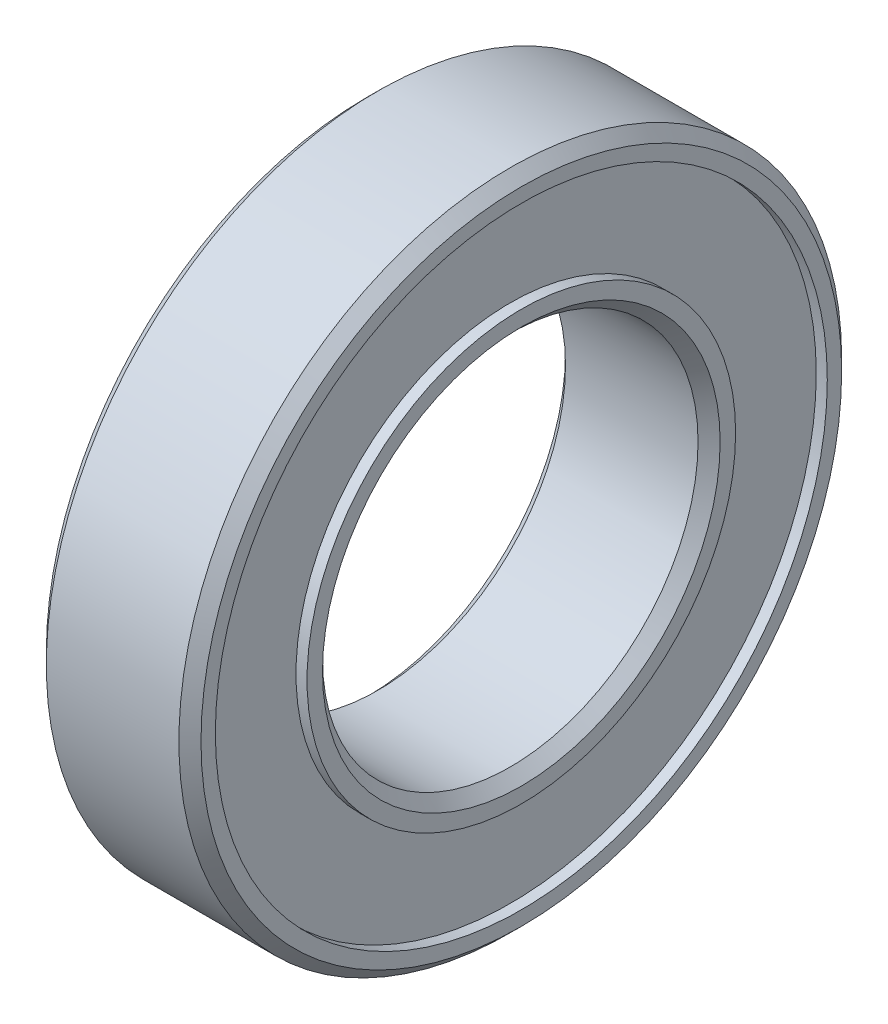
ISO-10303-21;
HEADER;
FILE_DESCRIPTION(('STEP AP214'),'2;1');
FILE_NAME('part.step','',(''),(''),'','','');
FILE_SCHEMA(('AUTOMOTIVE_DESIGN { 1 0 10303 214 1 1 1 1 }'));
ENDSEC;
DATA;
#1=APPLICATION_CONTEXT('core data for automotive mechanical design processes');
#2=APPLICATION_PROTOCOL_DEFINITION('international standard','automotive_design',2000,#1);
#3=PRODUCT_CONTEXT('',#1,'mechanical');
#4=PRODUCT('Part','Part','',(#3));
#5=PRODUCT_RELATED_PRODUCT_CATEGORY('part','',(#4));
#6=PRODUCT_DEFINITION_FORMATION('','',#4);
#7=PRODUCT_DEFINITION_CONTEXT('part definition',#1,'design');
#8=PRODUCT_DEFINITION('design','',#6,#7);
#9=PRODUCT_DEFINITION_SHAPE('','',#8);
#10=(LENGTH_UNIT() NAMED_UNIT(*) SI_UNIT(.MILLI.,.METRE.));
#11=(NAMED_UNIT(*) PLANE_ANGLE_UNIT() SI_UNIT($,.RADIAN.));
#12=(NAMED_UNIT(*) SI_UNIT($,.STERADIAN.) SOLID_ANGLE_UNIT());
#13=UNCERTAINTY_MEASURE_WITH_UNIT(LENGTH_MEASURE(1.E-05),#10,'distance_accuracy_value','');
#14=(GEOMETRIC_REPRESENTATION_CONTEXT(3) GLOBAL_UNCERTAINTY_ASSIGNED_CONTEXT((#13)) GLOBAL_UNIT_ASSIGNED_CONTEXT((#10,
#11,#12)) REPRESENTATION_CONTEXT('',''));
#15=CARTESIAN_POINT('',(0.,0.,0.));
#16=DIRECTION('',(0.,0.,1.));
#17=DIRECTION('',(1.,0.,0.));
#18=AXIS2_PLACEMENT_3D('',#15,#16,#17);
#19=CARTESIAN_POINT('',(0.,0.,0.));
#20=DIRECTION('',(1.,0.,0.));
#21=DIRECTION('',(0.,0.,-1.));
#22=AXIS2_PLACEMENT_3D('',#19,#20,#21);
#23=PLANE('',#22);
#24=CARTESIAN_POINT('',(0.,0.,0.));
#25=DIRECTION('',(1.,0.,0.));
#26=DIRECTION('',(0.,0.,-1.));
#27=AXIS2_PLACEMENT_3D('',#24,#25,#26);
#28=CIRCLE('',#27,8.99999999999999);
#29=CARTESIAN_POINT('',(0.,0.,-8.99999999999999));
#30=VERTEX_POINT('',#29);
#31=EDGE_CURVE('E60',#30,#30,#28,.T.);
#32=ORIENTED_EDGE('',*,*,#31,.T.);
#33=EDGE_LOOP('',(#32));
#34=FACE_BOUND('',#33,.T.);
#35=CARTESIAN_POINT('',(0.,0.,0.));
#36=DIRECTION('',(-1.,0.,0.));
#37=DIRECTION('',(0.,0.,1.));
#38=AXIS2_PLACEMENT_3D('',#35,#36,#37);
#39=CIRCLE('',#38,9.7);
#40=CARTESIAN_POINT('',(0.,0.,9.7));
#41=VERTEX_POINT('',#40);
#42=EDGE_CURVE('E85',#41,#41,#39,.T.);
#43=ORIENTED_EDGE('',*,*,#42,.T.);
#44=EDGE_LOOP('',(#43));
#45=FACE_BOUND('',#44,.T.);
#46=ADVANCED_FACE('F33',(#34,#45),#23,.F.);
#47=CARTESIAN_POINT('',(7.,0.,0.));
#48=DIRECTION('',(1.,0.,0.));
#49=DIRECTION('',(0.,0.,-1.));
#50=AXIS2_PLACEMENT_3D('',#47,#48,#49);
#51=PLANE('',#50);
#52=CARTESIAN_POINT('',(7.,0.,0.));
#53=DIRECTION('',(1.,0.,0.));
#54=DIRECTION('',(0.,0.,-1.));
#55=AXIS2_PLACEMENT_3D('',#52,#53,#54);
#56=CIRCLE('',#55,9.);
#57=CARTESIAN_POINT('',(7.,0.,-9.));
#58=VERTEX_POINT('',#57);
#59=EDGE_CURVE('E10',#58,#58,#56,.F.);
#60=ORIENTED_EDGE('',*,*,#59,.T.);
#61=EDGE_LOOP('',(#60));
#62=FACE_BOUND('',#61,.T.);
#63=CARTESIAN_POINT('',(7.,0.,0.));
#64=DIRECTION('',(1.,0.,0.));
#65=DIRECTION('',(0.,0.,-1.));
#66=AXIS2_PLACEMENT_3D('',#63,#64,#65);
#67=CIRCLE('',#66,9.7);
#68=CARTESIAN_POINT('',(7.,0.,-9.7));
#69=VERTEX_POINT('',#68);
#70=EDGE_CURVE('E73',#69,#69,#67,.T.);
#71=ORIENTED_EDGE('',*,*,#70,.T.);
#72=EDGE_LOOP('',(#71));
#73=FACE_BOUND('',#72,.T.);
#74=ADVANCED_FACE('F141',(#62,#73),#51,.T.);
#75=CARTESIAN_POINT('',(7.,0.,0.));
#76=DIRECTION('',(1.,0.,0.));
#77=DIRECTION('',(0.,0.,-1.));
#78=AXIS2_PLACEMENT_3D('',#75,#76,#77);
#79=CIRCLE('',#78,13.85);
#80=CARTESIAN_POINT('',(7.,0.,-13.85));
#81=VERTEX_POINT('',#80);
#82=EDGE_CURVE('E67',#81,#81,#79,.T.);
#83=ORIENTED_EDGE('',*,*,#82,.F.);
#84=EDGE_LOOP('',(#83));
#85=FACE_BOUND('',#84,.T.);
#86=CARTESIAN_POINT('',(7.,0.,0.));
#87=DIRECTION('',(1.,0.,0.));
#88=DIRECTION('',(0.,0.,-1.));
#89=AXIS2_PLACEMENT_3D('',#86,#87,#88);
#90=CIRCLE('',#89,14.5);
#91=CARTESIAN_POINT('',(7.,0.,-14.5));
#92=VERTEX_POINT('',#91);
#93=EDGE_CURVE('E41',#92,#92,#90,.T.);
#94=ORIENTED_EDGE('',*,*,#93,.T.);
#95=EDGE_LOOP('',(#94));
#96=FACE_BOUND('',#95,.T.);
#97=ADVANCED_FACE('F111',(#85,#96),#51,.T.);
#98=CARTESIAN_POINT('',(0.,0.,0.));
#99=DIRECTION('',(-1.,0.,0.));
#100=DIRECTION('',(0.,0.,1.));
#101=AXIS2_PLACEMENT_3D('',#98,#99,#100);
#102=CIRCLE('',#101,13.85);
#103=CARTESIAN_POINT('',(0.,0.,13.85));
#104=VERTEX_POINT('',#103);
#105=EDGE_CURVE('E79',#104,#104,#102,.T.);
#106=ORIENTED_EDGE('',*,*,#105,.F.);
#107=EDGE_LOOP('',(#106));
#108=FACE_BOUND('',#107,.T.);
#109=CARTESIAN_POINT('',(0.,0.,0.));
#110=DIRECTION('',(1.,0.,0.));
#111=DIRECTION('',(0.,0.,-1.));
#112=AXIS2_PLACEMENT_3D('',#109,#110,#111);
#113=CIRCLE('',#112,14.5);
#114=CARTESIAN_POINT('',(0.,0.,-14.5));
#115=VERTEX_POINT('',#114);
#116=EDGE_CURVE('E63',#115,#115,#113,.F.);
#117=ORIENTED_EDGE('',*,*,#116,.T.);
#118=EDGE_LOOP('',(#117));
#119=FACE_BOUND('',#118,.T.);
#120=ADVANCED_FACE('F107',(#108,#119),#23,.F.);
#121=CARTESIAN_POINT('',(7.,0.,0.));
#122=DIRECTION('',(-1.,0.,0.));
#123=DIRECTION('',(0.,0.,1.));
#124=AXIS2_PLACEMENT_3D('',#121,#122,#123);
#125=CYLINDRICAL_SURFACE('',#124,15.);
#126=CARTESIAN_POINT('',(0.499999999999999,0.,0.));
#127=DIRECTION('',(1.,0.,0.));
#128=DIRECTION('',(0.,0.,-1.));
#129=AXIS2_PLACEMENT_3D('',#126,#127,#128);
#130=CIRCLE('',#129,15.);
#131=CARTESIAN_POINT('',(0.499999999999999,0.,-15.));
#132=VERTEX_POINT('',#131);
#133=EDGE_CURVE('E45',#132,#132,#130,.T.);
#134=ORIENTED_EDGE('',*,*,#133,.T.);
#135=EDGE_LOOP('',(#134));
#136=FACE_BOUND('',#135,.T.);
#137=CARTESIAN_POINT('',(6.5,0.,0.));
#138=DIRECTION('',(1.,0.,0.));
#139=DIRECTION('',(0.,0.,-1.));
#140=AXIS2_PLACEMENT_3D('',#137,#138,#139);
#141=CIRCLE('',#140,15.);
#142=CARTESIAN_POINT('',(6.5,0.,-15.));
#143=VERTEX_POINT('',#142);
#144=EDGE_CURVE('E49',#143,#143,#141,.F.);
#145=ORIENTED_EDGE('',*,*,#144,.T.);
#146=EDGE_LOOP('',(#145));
#147=FACE_BOUND('',#146,.T.);
#148=ADVANCED_FACE('F110',(#136,#147),#125,.T.);
#149=CARTESIAN_POINT('',(7.,0.,0.));
#150=DIRECTION('',(-1.,0.,0.));
#151=DIRECTION('',(0.,0.,1.));
#152=AXIS2_PLACEMENT_3D('',#149,#150,#151);
#153=CYLINDRICAL_SURFACE('',#152,8.5);
#154=CARTESIAN_POINT('',(0.499999999999997,0.,0.));
#155=DIRECTION('',(1.,0.,0.));
#156=DIRECTION('',(0.,0.,-1.));
#157=AXIS2_PLACEMENT_3D('',#154,#155,#156);
#158=CIRCLE('',#157,8.5);
#159=CARTESIAN_POINT('',(0.499999999999997,0.,-8.5));
#160=VERTEX_POINT('',#159);
#161=EDGE_CURVE('E54',#160,#160,#158,.F.);
#162=ORIENTED_EDGE('',*,*,#161,.T.);
#163=EDGE_LOOP('',(#162));
#164=FACE_BOUND('',#163,.T.);
#165=CARTESIAN_POINT('',(6.5,0.,0.));
#166=DIRECTION('',(1.,0.,0.));
#167=DIRECTION('',(0.,0.,-1.));
#168=AXIS2_PLACEMENT_3D('',#165,#166,#167);
#169=CIRCLE('',#168,8.5);
#170=CARTESIAN_POINT('',(6.5,0.,-8.5));
#171=VERTEX_POINT('',#170);
#172=EDGE_CURVE('E57',#171,#171,#169,.T.);
#173=ORIENTED_EDGE('',*,*,#172,.T.);
#174=EDGE_LOOP('',(#173));
#175=FACE_BOUND('',#174,.T.);
#176=ADVANCED_FACE('F125',(#164,#175),#153,.F.);
#177=CARTESIAN_POINT('',(0.,0.,0.));
#178=DIRECTION('',(-1.,0.,0.));
#179=DIRECTION('',(0.,0.,1.));
#180=AXIS2_PLACEMENT_3D('',#177,#178,#179);
#181=CONICAL_SURFACE('',#180,8.99999999999999,0.785398163397447);
#182=ORIENTED_EDGE('',*,*,#161,.F.);
#183=EDGE_LOOP('',(#182));
#184=FACE_BOUND('',#183,.T.);
#185=ORIENTED_EDGE('',*,*,#31,.F.);
#186=EDGE_LOOP('',(#185));
#187=FACE_BOUND('',#186,.T.);
#188=ADVANCED_FACE('F119',(#184,#187),#181,.F.);
#189=CARTESIAN_POINT('',(0.499999999999999,0.,0.));
#190=DIRECTION('',(1.,0.,0.));
#191=DIRECTION('',(0.,0.,-1.));
#192=AXIS2_PLACEMENT_3D('',#189,#190,#191);
#193=CONICAL_SURFACE('',#192,15.,0.785398163397448);
#194=ORIENTED_EDGE('',*,*,#116,.F.);
#195=EDGE_LOOP('',(#194));
#196=FACE_BOUND('',#195,.T.);
#197=ORIENTED_EDGE('',*,*,#133,.F.);
#198=EDGE_LOOP('',(#197));
#199=FACE_BOUND('',#198,.T.);
#200=ADVANCED_FACE('F115',(#196,#199),#193,.T.);
#201=CARTESIAN_POINT('',(6.5,0.,0.));
#202=DIRECTION('',(1.,0.,0.));
#203=DIRECTION('',(0.,0.,-1.));
#204=AXIS2_PLACEMENT_3D('',#201,#202,#203);
#205=CONICAL_SURFACE('',#204,8.5,0.785398163397453);
#206=ORIENTED_EDGE('',*,*,#59,.F.);
#207=EDGE_LOOP('',(#206));
#208=FACE_BOUND('',#207,.T.);
#209=ORIENTED_EDGE('',*,*,#172,.F.);
#210=EDGE_LOOP('',(#209));
#211=FACE_BOUND('',#210,.T.);
#212=ADVANCED_FACE('F118',(#208,#211),#205,.F.);
#213=CARTESIAN_POINT('',(7.,0.,0.));
#214=DIRECTION('',(-1.,0.,0.));
#215=DIRECTION('',(0.,0.,1.));
#216=AXIS2_PLACEMENT_3D('',#213,#214,#215);
#217=CONICAL_SURFACE('',#216,14.5,0.78539816339745);
#218=ORIENTED_EDGE('',*,*,#144,.F.);
#219=EDGE_LOOP('',(#218));
#220=FACE_BOUND('',#219,.T.);
#221=ORIENTED_EDGE('',*,*,#93,.F.);
#222=EDGE_LOOP('',(#221));
#223=FACE_BOUND('',#222,.T.);
#224=ADVANCED_FACE('F36',(#220,#223),#217,.T.);
#225=CARTESIAN_POINT('',(6.5,0.,0.));
#226=DIRECTION('',(1.,0.,0.));
#227=DIRECTION('',(0.,0.,-1.));
#228=AXIS2_PLACEMENT_3D('',#225,#226,#227);
#229=CYLINDRICAL_SURFACE('',#228,13.85);
#230=CARTESIAN_POINT('',(6.5,0.,0.));
#231=DIRECTION('',(1.,0.,0.));
#232=DIRECTION('',(0.,0.,-1.));
#233=AXIS2_PLACEMENT_3D('',#230,#231,#232);
#234=CIRCLE('',#233,13.85);
#235=CARTESIAN_POINT('',(6.5,0.,-13.85));
#236=VERTEX_POINT('',#235);
#237=EDGE_CURVE('E66',#236,#236,#234,.T.);
#238=ORIENTED_EDGE('',*,*,#237,.F.);
#239=EDGE_LOOP('',(#238));
#240=FACE_BOUND('',#239,.T.);
#241=ORIENTED_EDGE('',*,*,#82,.T.);
#242=EDGE_LOOP('',(#241));
#243=FACE_BOUND('',#242,.T.);
#244=ADVANCED_FACE('F131',(#240,#243),#229,.F.);
#245=CARTESIAN_POINT('',(6.5,0.,0.));
#246=DIRECTION('',(1.,0.,0.));
#247=DIRECTION('',(0.,0.,-1.));
#248=AXIS2_PLACEMENT_3D('',#245,#246,#247);
#249=PLANE('',#248);
#250=CARTESIAN_POINT('',(6.5,0.,0.));
#251=DIRECTION('',(1.,0.,0.));
#252=DIRECTION('',(0.,0.,-1.));
#253=AXIS2_PLACEMENT_3D('',#250,#251,#252);
#254=CIRCLE('',#253,9.7);
#255=CARTESIAN_POINT('',(6.5,0.,-9.7));
#256=VERTEX_POINT('',#255);
#257=EDGE_CURVE('E70',#256,#256,#254,.T.);
#258=ORIENTED_EDGE('',*,*,#257,.F.);
#259=EDGE_LOOP('',(#258));
#260=FACE_BOUND('',#259,.T.);
#261=ORIENTED_EDGE('',*,*,#237,.T.);
#262=EDGE_LOOP('',(#261));
#263=FACE_BOUND('',#262,.T.);
#264=ADVANCED_FACE('F136',(#260,#263),#249,.T.);
#265=CARTESIAN_POINT('',(6.5,0.,0.));
#266=DIRECTION('',(1.,0.,0.));
#267=DIRECTION('',(0.,0.,-1.));
#268=AXIS2_PLACEMENT_3D('',#265,#266,#267);
#269=CYLINDRICAL_SURFACE('',#268,9.7);
#270=ORIENTED_EDGE('',*,*,#257,.T.);
#271=EDGE_LOOP('',(#270));
#272=FACE_BOUND('',#271,.T.);
#273=ORIENTED_EDGE('',*,*,#70,.F.);
#274=EDGE_LOOP('',(#273));
#275=FACE_BOUND('',#274,.T.);
#276=ADVANCED_FACE('F103',(#272,#275),#269,.T.);
#277=CARTESIAN_POINT('',(0.5,0.,0.));
#278=DIRECTION('',(-1.,0.,0.));
#279=DIRECTION('',(0.,0.,1.));
#280=AXIS2_PLACEMENT_3D('',#277,#278,#279);
#281=CYLINDRICAL_SURFACE('',#280,13.85);
#282=CARTESIAN_POINT('',(0.5,0.,0.));
#283=DIRECTION('',(-1.,0.,0.));
#284=DIRECTION('',(0.,0.,1.));
#285=AXIS2_PLACEMENT_3D('',#282,#283,#284);
#286=CIRCLE('',#285,13.85);
#287=CARTESIAN_POINT('',(0.5,0.,13.85));
#288=VERTEX_POINT('',#287);
#289=EDGE_CURVE('E76',#288,#288,#286,.T.);
#290=ORIENTED_EDGE('',*,*,#289,.F.);
#291=EDGE_LOOP('',(#290));
#292=FACE_BOUND('',#291,.T.);
#293=ORIENTED_EDGE('',*,*,#105,.T.);
#294=EDGE_LOOP('',(#293));
#295=FACE_BOUND('',#294,.T.);
#296=ADVANCED_FACE('F97',(#292,#295),#281,.F.);
#297=CARTESIAN_POINT('',(0.5,0.,0.));
#298=DIRECTION('',(-1.,0.,0.));
#299=DIRECTION('',(0.,0.,1.));
#300=AXIS2_PLACEMENT_3D('',#297,#298,#299);
#301=PLANE('',#300);
#302=CARTESIAN_POINT('',(0.5,0.,0.));
#303=DIRECTION('',(-1.,0.,0.));
#304=DIRECTION('',(0.,0.,1.));
#305=AXIS2_PLACEMENT_3D('',#302,#303,#304);
#306=CIRCLE('',#305,9.7);
#307=CARTESIAN_POINT('',(0.5,0.,9.7));
#308=VERTEX_POINT('',#307);
#309=EDGE_CURVE('E82',#308,#308,#306,.T.);
#310=ORIENTED_EDGE('',*,*,#309,.F.);
#311=EDGE_LOOP('',(#310));
#312=FACE_BOUND('',#311,.T.);
#313=ORIENTED_EDGE('',*,*,#289,.T.);
#314=EDGE_LOOP('',(#313));
#315=FACE_BOUND('',#314,.T.);
#316=ADVANCED_FACE('F94',(#312,#315),#301,.T.);
#317=CARTESIAN_POINT('',(0.5,0.,0.));
#318=DIRECTION('',(-1.,0.,0.));
#319=DIRECTION('',(0.,0.,1.));
#320=AXIS2_PLACEMENT_3D('',#317,#318,#319);
#321=CYLINDRICAL_SURFACE('',#320,9.7);
#322=ORIENTED_EDGE('',*,*,#309,.T.);
#323=EDGE_LOOP('',(#322));
#324=FACE_BOUND('',#323,.T.);
#325=ORIENTED_EDGE('',*,*,#42,.F.);
#326=EDGE_LOOP('',(#325));
#327=FACE_BOUND('',#326,.T.);
#328=ADVANCED_FACE('F91',(#324,#327),#321,.T.);
#329=CLOSED_SHELL('',(#46,#74,#97,#120,#148,#176,#188,#200,#212,#224,#244,#264,#276,#296,#316,#328));
#330=MANIFOLD_SOLID_BREP('B2',#329);
#331=ADVANCED_BREP_SHAPE_REPRESENTATION('',(#18,#330),#14);
#332=SHAPE_DEFINITION_REPRESENTATION(#9,#331);
ENDSEC;
END-ISO-10303-21;
